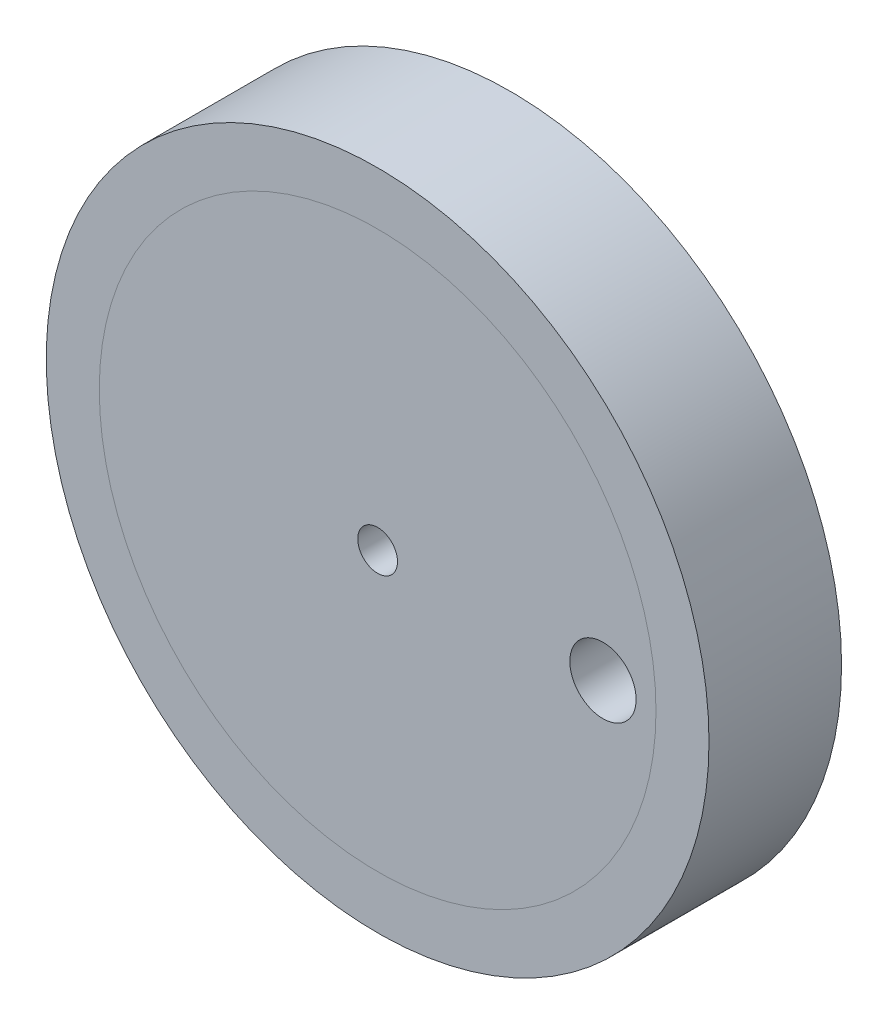
ISO-10303-21;
HEADER;
FILE_DESCRIPTION(('STEP AP214'),'2;1');
FILE_NAME('part.step','',(''),(''),'','','');
FILE_SCHEMA(('AUTOMOTIVE_DESIGN { 1 0 10303 214 1 1 1 1 }'));
ENDSEC;
DATA;
#1=APPLICATION_CONTEXT('core data for automotive mechanical design processes');
#2=APPLICATION_PROTOCOL_DEFINITION('international standard','automotive_design',2000,#1);
#3=PRODUCT_CONTEXT('',#1,'mechanical');
#4=PRODUCT('Part','Part','',(#3));
#5=PRODUCT_RELATED_PRODUCT_CATEGORY('part','',(#4));
#6=PRODUCT_DEFINITION_FORMATION('','',#4);
#7=PRODUCT_DEFINITION_CONTEXT('part definition',#1,'design');
#8=PRODUCT_DEFINITION('design','',#6,#7);
#9=PRODUCT_DEFINITION_SHAPE('','',#8);
#10=(LENGTH_UNIT() NAMED_UNIT(*) SI_UNIT(.MILLI.,.METRE.));
#11=(NAMED_UNIT(*) PLANE_ANGLE_UNIT() SI_UNIT($,.RADIAN.));
#12=(NAMED_UNIT(*) SI_UNIT($,.STERADIAN.) SOLID_ANGLE_UNIT());
#13=UNCERTAINTY_MEASURE_WITH_UNIT(LENGTH_MEASURE(1.E-05),#10,'distance_accuracy_value','');
#14=(GEOMETRIC_REPRESENTATION_CONTEXT(3) GLOBAL_UNCERTAINTY_ASSIGNED_CONTEXT((#13)) GLOBAL_UNIT_ASSIGNED_CONTEXT((#10,
#11,#12)) REPRESENTATION_CONTEXT('',''));
#15=CARTESIAN_POINT('',(0.,0.,0.));
#16=DIRECTION('',(0.,0.,1.));
#17=DIRECTION('',(1.,0.,0.));
#18=AXIS2_PLACEMENT_3D('',#15,#16,#17);
#19=CARTESIAN_POINT('',(-26.1266167793171,11.2614727497056,69.39696961967));
#20=DIRECTION('',(0.,0.,-1.));
#21=DIRECTION('',(-1.,0.,0.));
#22=AXIS2_PLACEMENT_3D('',#19,#20,#21);
#23=CYLINDRICAL_SURFACE('',#22,21.);
#24=CARTESIAN_POINT('',(-26.1266167793171,11.2614727497056,0.));
#25=DIRECTION('',(0.,0.,-1.));
#26=DIRECTION('',(-1.,0.,0.));
#27=AXIS2_PLACEMENT_3D('',#24,#25,#26);
#28=CIRCLE('',#27,21.);
#29=CARTESIAN_POINT('',(-47.1266167793171,11.2614727497056,0.));
#30=VERTEX_POINT('',#29);
#31=EDGE_CURVE('E57',#30,#30,#28,.T.);
#32=ORIENTED_EDGE('',*,*,#31,.F.);
#33=EDGE_LOOP('',(#32));
#34=FACE_BOUND('',#33,.T.);
#35=CARTESIAN_POINT('',(-26.1266167793171,11.2614727497056,10.));
#36=DIRECTION('',(0.,0.,1.));
#37=DIRECTION('',(1.,0.,0.));
#38=AXIS2_PLACEMENT_3D('',#35,#36,#37);
#39=CIRCLE('',#38,21.);
#40=CARTESIAN_POINT('',(-5.12661677931709,11.2614727497056,10.));
#41=VERTEX_POINT('',#40);
#42=EDGE_CURVE('E48',#41,#41,#39,.F.);
#43=ORIENTED_EDGE('',*,*,#42,.T.);
#44=EDGE_LOOP('',(#43));
#45=FACE_BOUND('',#44,.T.);
#46=ADVANCED_FACE('F44',(#34,#45),#23,.T.);
#47=CARTESIAN_POINT('',(-26.1266167793171,11.2614727497056,69.39696961967));
#48=DIRECTION('',(0.,0.,-1.));
#49=DIRECTION('',(-1.,0.,0.));
#50=AXIS2_PLACEMENT_3D('',#47,#48,#49);
#51=CYLINDRICAL_SURFACE('',#50,1.5);
#52=CARTESIAN_POINT('',(-26.1266167793171,11.2614727497056,0.));
#53=DIRECTION('',(0.,0.,-1.));
#54=DIRECTION('',(-1.,0.,0.));
#55=AXIS2_PLACEMENT_3D('',#52,#53,#54);
#56=CIRCLE('',#55,1.5);
#57=CARTESIAN_POINT('',(-27.6266167793171,11.2614727497056,0.));
#58=VERTEX_POINT('',#57);
#59=EDGE_CURVE('E62',#58,#58,#56,.T.);
#60=ORIENTED_EDGE('',*,*,#59,.T.);
#61=EDGE_LOOP('',(#60));
#62=FACE_BOUND('',#61,.T.);
#63=CARTESIAN_POINT('',(-26.1266167793171,11.2614727497056,10.));
#64=DIRECTION('',(0.,0.,1.));
#65=DIRECTION('',(1.,0.,0.));
#66=AXIS2_PLACEMENT_3D('',#63,#64,#65);
#67=CIRCLE('',#66,1.5);
#68=CARTESIAN_POINT('',(-24.6266167793171,11.2614727497056,10.));
#69=VERTEX_POINT('',#68);
#70=EDGE_CURVE('E11',#69,#69,#67,.F.);
#71=ORIENTED_EDGE('',*,*,#70,.F.);
#72=EDGE_LOOP('',(#71));
#73=FACE_BOUND('',#72,.T.);
#74=ADVANCED_FACE('F72',(#62,#73),#51,.F.);
#75=CARTESIAN_POINT('',(-9.12661677931708,11.2614727497056,69.39696961967));
#76=DIRECTION('',(0.,0.,-1.));
#77=DIRECTION('',(-1.,0.,0.));
#78=AXIS2_PLACEMENT_3D('',#75,#76,#77);
#79=CYLINDRICAL_SURFACE('',#78,2.5);
#80=CARTESIAN_POINT('',(-9.12661677931708,11.2614727497056,0.));
#81=DIRECTION('',(0.,0.,-1.));
#82=DIRECTION('',(-1.,0.,0.));
#83=AXIS2_PLACEMENT_3D('',#80,#81,#82);
#84=CIRCLE('',#83,2.5);
#85=CARTESIAN_POINT('',(-11.6266167793171,11.2614727497056,0.));
#86=VERTEX_POINT('',#85);
#87=EDGE_CURVE('E59',#86,#86,#84,.T.);
#88=ORIENTED_EDGE('',*,*,#87,.T.);
#89=EDGE_LOOP('',(#88));
#90=FACE_BOUND('',#89,.T.);
#91=CARTESIAN_POINT('',(-9.12661677931708,11.2614727497056,10.));
#92=DIRECTION('',(0.,0.,1.));
#93=DIRECTION('',(1.,0.,0.));
#94=AXIS2_PLACEMENT_3D('',#91,#92,#93);
#95=CIRCLE('',#94,2.5);
#96=CARTESIAN_POINT('',(-6.62661677931708,11.2614727497056,10.));
#97=VERTEX_POINT('',#96);
#98=EDGE_CURVE('E52',#97,#97,#95,.F.);
#99=ORIENTED_EDGE('',*,*,#98,.F.);
#100=EDGE_LOOP('',(#99));
#101=FACE_BOUND('',#100,.T.);
#102=ADVANCED_FACE('F81',(#90,#101),#79,.F.);
#103=CARTESIAN_POINT('',(-26.1266167793171,11.2614727497056,0.));
#104=DIRECTION('',(0.,0.,-1.));
#105=DIRECTION('',(-1.,0.,0.));
#106=AXIS2_PLACEMENT_3D('',#103,#104,#105);
#107=PLANE('',#106);
#108=ORIENTED_EDGE('',*,*,#87,.F.);
#109=EDGE_LOOP('',(#108));
#110=FACE_BOUND('',#109,.T.);
#111=ORIENTED_EDGE('',*,*,#59,.F.);
#112=EDGE_LOOP('',(#111));
#113=FACE_BOUND('',#112,.T.);
#114=ORIENTED_EDGE('',*,*,#31,.T.);
#115=EDGE_LOOP('',(#114));
#116=FACE_BOUND('',#115,.T.);
#117=ADVANCED_FACE('F68',(#110,#113,#116),#107,.T.);
#118=CARTESIAN_POINT('',(-26.1266167793171,11.2614727497056,10.));
#119=DIRECTION('',(0.,0.,1.));
#120=DIRECTION('',(1.,0.,0.));
#121=AXIS2_PLACEMENT_3D('',#118,#119,#120);
#122=PLANE('',#121);
#123=ORIENTED_EDGE('',*,*,#42,.F.);
#124=EDGE_LOOP('',(#123));
#125=FACE_BOUND('',#124,.T.);
#126=ORIENTED_EDGE('',*,*,#98,.T.);
#127=EDGE_LOOP('',(#126));
#128=FACE_BOUND('',#127,.T.);
#129=ORIENTED_EDGE('',*,*,#70,.T.);
#130=EDGE_LOOP('',(#129));
#131=FACE_BOUND('',#130,.T.);
#132=ADVANCED_FACE('F46',(#125,#128,#131),#122,.T.);
#133=CLOSED_SHELL('',(#46,#74,#102,#117,#132));
#134=MANIFOLD_SOLID_BREP('B2',#133);
#135=CARTESIAN_POINT('',(-26.1266167793171,11.2614727497056,10.));
#136=DIRECTION('',(0.,0.,-1.));
#137=DIRECTION('',(-1.,0.,0.));
#138=AXIS2_PLACEMENT_3D('',#135,#136,#137);
#139=CYLINDRICAL_SURFACE('',#138,25.);
#140=CARTESIAN_POINT('',(-26.1266167793171,11.2614727497056,10.));
#141=DIRECTION('',(0.,0.,1.));
#142=DIRECTION('',(1.,0.,0.));
#143=AXIS2_PLACEMENT_3D('',#140,#141,#142);
#144=CIRCLE('',#143,25.);
#145=CARTESIAN_POINT('',(-1.12661677931708,11.2614727497056,10.));
#146=VERTEX_POINT('',#145);
#147=EDGE_CURVE('E43',#146,#146,#144,.T.);
#148=ORIENTED_EDGE('',*,*,#147,.F.);
#149=EDGE_LOOP('',(#148));
#150=FACE_BOUND('',#149,.T.);
#151=CARTESIAN_POINT('',(-26.1266167793171,11.2614727497056,0.));
#152=DIRECTION('',(0.,0.,1.));
#153=DIRECTION('',(1.,0.,0.));
#154=AXIS2_PLACEMENT_3D('',#151,#152,#153);
#155=CIRCLE('',#154,25.);
#156=CARTESIAN_POINT('',(-1.12661677931708,11.2614727497056,0.));
#157=VERTEX_POINT('',#156);
#158=EDGE_CURVE('E133',#157,#157,#155,.T.);
#159=ORIENTED_EDGE('',*,*,#158,.T.);
#160=EDGE_LOOP('',(#159));
#161=FACE_BOUND('',#160,.T.);
#162=ADVANCED_FACE('F126',(#150,#161),#139,.T.);
#163=CARTESIAN_POINT('',(-26.1266167793171,11.2614727497056,10.));
#164=DIRECTION('',(0.,0.,1.));
#165=DIRECTION('',(1.,0.,0.));
#166=AXIS2_PLACEMENT_3D('',#163,#164,#165);
#167=PLANE('',#166);
#168=CARTESIAN_POINT('',(-26.1266167793171,11.2614727497056,10.));
#169=DIRECTION('',(0.,0.,1.));
#170=DIRECTION('',(1.,0.,0.));
#171=AXIS2_PLACEMENT_3D('',#168,#169,#170);
#172=CIRCLE('',#171,21.);
#173=CARTESIAN_POINT('',(-5.12661677931708,11.2614727497056,10.));
#174=VERTEX_POINT('',#173);
#175=EDGE_CURVE('E139',#174,#174,#172,.T.);
#176=ORIENTED_EDGE('',*,*,#175,.F.);
#177=EDGE_LOOP('',(#176));
#178=FACE_BOUND('',#177,.T.);
#179=ORIENTED_EDGE('',*,*,#147,.T.);
#180=EDGE_LOOP('',(#179));
#181=FACE_BOUND('',#180,.T.);
#182=ADVANCED_FACE('F155',(#178,#181),#167,.T.);
#183=CARTESIAN_POINT('',(-26.1266167793171,11.2614727497056,0.));
#184=DIRECTION('',(0.,0.,1.));
#185=DIRECTION('',(1.,0.,0.));
#186=AXIS2_PLACEMENT_3D('',#183,#184,#185);
#187=PLANE('',#186);
#188=CARTESIAN_POINT('',(-26.1266167793171,11.2614727497056,0.));
#189=DIRECTION('',(0.,0.,1.));
#190=DIRECTION('',(1.,0.,0.));
#191=AXIS2_PLACEMENT_3D('',#188,#189,#190);
#192=CIRCLE('',#191,21.);
#193=CARTESIAN_POINT('',(-5.12661677931708,11.2614727497056,0.));
#194=VERTEX_POINT('',#193);
#195=EDGE_CURVE('E129',#194,#194,#192,.T.);
#196=ORIENTED_EDGE('',*,*,#195,.T.);
#197=EDGE_LOOP('',(#196));
#198=FACE_BOUND('',#197,.T.);
#199=ORIENTED_EDGE('',*,*,#158,.F.);
#200=EDGE_LOOP('',(#199));
#201=FACE_BOUND('',#200,.T.);
#202=ADVANCED_FACE('F146',(#198,#201),#187,.F.);
#203=CARTESIAN_POINT('',(-26.1266167793171,11.2614727497056,-9.99999999994061E-05));
#204=DIRECTION('',(0.,0.,1.));
#205=DIRECTION('',(1.,0.,0.));
#206=AXIS2_PLACEMENT_3D('',#203,#204,#205);
#207=CYLINDRICAL_SURFACE('',#206,21.);
#208=ORIENTED_EDGE('',*,*,#175,.T.);
#209=EDGE_LOOP('',(#208));
#210=FACE_BOUND('',#209,.T.);
#211=ORIENTED_EDGE('',*,*,#195,.F.);
#212=EDGE_LOOP('',(#211));
#213=FACE_BOUND('',#212,.T.);
#214=ADVANCED_FACE('F149',(#210,#213),#207,.F.);
#215=CLOSED_SHELL('',(#162,#182,#202,#214));
#216=MANIFOLD_SOLID_BREP('B6',#215);
#217=ADVANCED_BREP_SHAPE_REPRESENTATION('',(#18,#134,#216),#14);
#218=SHAPE_DEFINITION_REPRESENTATION(#9,#217);
ENDSEC;
END-ISO-10303-21;
